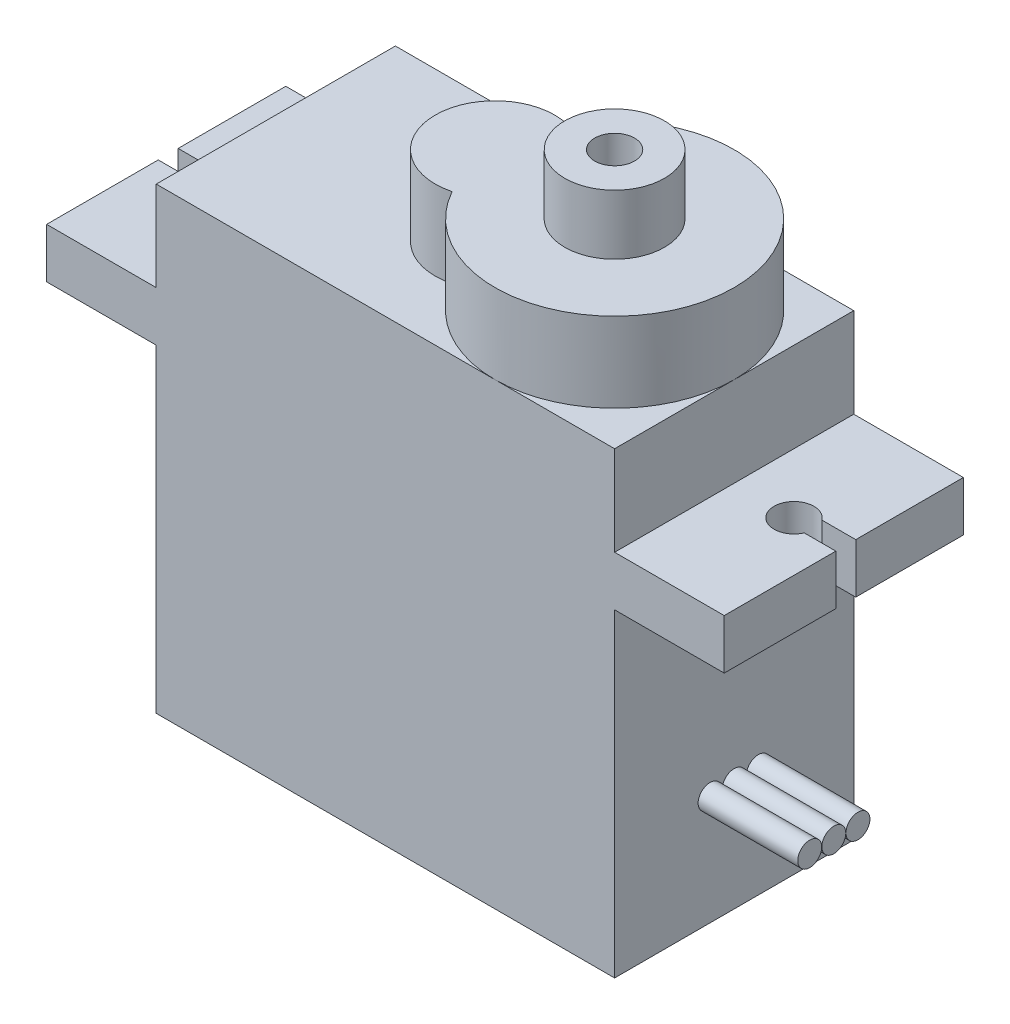
ISO-10303-21;
HEADER;
FILE_DESCRIPTION(('STEP AP214'),'2;1');
FILE_NAME('part.step','',(''),(''),'','','');
FILE_SCHEMA(('AUTOMOTIVE_DESIGN { 1 0 10303 214 1 1 1 1 }'));
ENDSEC;
DATA;
#1=APPLICATION_CONTEXT('core data for automotive mechanical design processes');
#2=APPLICATION_PROTOCOL_DEFINITION('international standard','automotive_design',2000,#1);
#3=PRODUCT_CONTEXT('',#1,'mechanical');
#4=PRODUCT('Part','Part','',(#3));
#5=PRODUCT_RELATED_PRODUCT_CATEGORY('part','',(#4));
#6=PRODUCT_DEFINITION_FORMATION('','',#4);
#7=PRODUCT_DEFINITION_CONTEXT('part definition',#1,'design');
#8=PRODUCT_DEFINITION('design','',#6,#7);
#9=PRODUCT_DEFINITION_SHAPE('','',#8);
#10=(LENGTH_UNIT() NAMED_UNIT(*) SI_UNIT(.MILLI.,.METRE.));
#11=(NAMED_UNIT(*) PLANE_ANGLE_UNIT() SI_UNIT($,.RADIAN.));
#12=(NAMED_UNIT(*) SI_UNIT($,.STERADIAN.) SOLID_ANGLE_UNIT());
#13=UNCERTAINTY_MEASURE_WITH_UNIT(LENGTH_MEASURE(1.E-05),#10,'distance_accuracy_value','');
#14=(GEOMETRIC_REPRESENTATION_CONTEXT(3) GLOBAL_UNCERTAINTY_ASSIGNED_CONTEXT((#13)) GLOBAL_UNIT_ASSIGNED_CONTEXT((#10,
#11,#12)) REPRESENTATION_CONTEXT('',''));
#15=CARTESIAN_POINT('',(0.,0.,0.));
#16=DIRECTION('',(0.,0.,1.));
#17=DIRECTION('',(1.,0.,0.));
#18=AXIS2_PLACEMENT_3D('',#15,#16,#17);
#19=CARTESIAN_POINT('',(0.,23.,0.));
#20=DIRECTION('',(0.,-1.,0.));
#21=DIRECTION('',(0.,0.,-1.));
#22=AXIS2_PLACEMENT_3D('',#19,#20,#21);
#23=PLANE('',#22);
#24=CARTESIAN_POINT('',(-0.5,23.,0.));
#25=DIRECTION('',(0.,1.,0.));
#26=DIRECTION('',(0.,0.,1.));
#27=AXIS2_PLACEMENT_3D('',#24,#25,#26);
#28=CIRCLE('',#27,3.);
#29=CARTESIAN_POINT('',(0.249999999999997,23.,-2.90473750965557));
#30=VERTEX_POINT('',#29);
#31=CARTESIAN_POINT('',(0.249999999999996,23.,2.90473750965556));
#32=VERTEX_POINT('',#31);
#33=EDGE_CURVE('E208',#30,#32,#28,.T.);
#34=ORIENTED_EDGE('',*,*,#33,.F.);
#35=CARTESIAN_POINT('',(5.5,23.,0.));
#36=DIRECTION('',(0.,1.,0.));
#37=DIRECTION('',(0.,0.,1.));
#38=AXIS2_PLACEMENT_3D('',#35,#36,#37);
#39=CIRCLE('',#38,6.);
#40=CARTESIAN_POINT('',(5.5,23.,-6.));
#41=VERTEX_POINT('',#40);
#42=EDGE_CURVE('E364',#41,#30,#39,.T.);
#43=ORIENTED_EDGE('',*,*,#42,.F.);
#44=DIRECTION('',(-1.,0.,0.));
#45=VECTOR('',#44,1.);
#46=CARTESIAN_POINT('',(-11.5,23.,-6.));
#47=LINE('',#46,#45);
#48=CARTESIAN_POINT('',(-11.5,23.,-6.));
#49=VERTEX_POINT('',#48);
#50=EDGE_CURVE('E315',#41,#49,#47,.T.);
#51=ORIENTED_EDGE('',*,*,#50,.T.);
#52=DIRECTION('',(0.,0.,1.));
#53=VECTOR('',#52,1.);
#54=CARTESIAN_POINT('',(-11.5,23.,6.));
#55=LINE('',#54,#53);
#56=CARTESIAN_POINT('',(-11.5,23.,6.));
#57=VERTEX_POINT('',#56);
#58=EDGE_CURVE('E320',#49,#57,#55,.T.);
#59=ORIENTED_EDGE('',*,*,#58,.T.);
#60=DIRECTION('',(1.,0.,0.));
#61=VECTOR('',#60,1.);
#62=CARTESIAN_POINT('',(-11.5,23.,6.));
#63=LINE('',#62,#61);
#64=CARTESIAN_POINT('',(5.5,23.,6.));
#65=VERTEX_POINT('',#64);
#66=EDGE_CURVE('E323',#57,#65,#63,.T.);
#67=ORIENTED_EDGE('',*,*,#66,.T.);
#68=EDGE_CURVE('E47',#32,#65,#39,.T.);
#69=ORIENTED_EDGE('',*,*,#68,.F.);
#70=EDGE_LOOP('',(#34,#43,#51,#59,#67,#69));
#71=FACE_BOUND('',#70,.T.);
#72=ADVANCED_FACE('F32',(#71),#23,.F.);
#73=CARTESIAN_POINT('',(11.5,23.,0.));
#74=VERTEX_POINT('',#73);
#75=EDGE_CURVE('E55',#65,#74,#39,.T.);
#76=ORIENTED_EDGE('',*,*,#75,.F.);
#77=CARTESIAN_POINT('',(11.5,23.,6.));
#78=VERTEX_POINT('',#77);
#79=EDGE_CURVE('E322',#65,#78,#63,.T.);
#80=ORIENTED_EDGE('',*,*,#79,.T.);
#81=DIRECTION('',(0.,0.,-1.));
#82=VECTOR('',#81,1.);
#83=CARTESIAN_POINT('',(11.5,23.,6.));
#84=LINE('',#83,#82);
#85=EDGE_CURVE('E313',#78,#74,#84,.T.);
#86=ORIENTED_EDGE('',*,*,#85,.T.);
#87=EDGE_LOOP('',(#76,#80,#86));
#88=FACE_BOUND('',#87,.T.);
#89=ADVANCED_FACE('F433',(#88),#23,.F.);
#90=CARTESIAN_POINT('',(17.,18.5,-6.));
#91=DIRECTION('',(0.,1.,0.));
#92=DIRECTION('',(0.,0.,1.));
#93=AXIS2_PLACEMENT_3D('',#90,#91,#92);
#94=PLANE('',#93);
#95=DIRECTION('',(0.,0.,-1.));
#96=VECTOR('',#95,1.);
#97=CARTESIAN_POINT('',(17.,18.5,-6.));
#98=LINE('',#97,#96);
#99=CARTESIAN_POINT('',(17.,18.5,6.));
#100=VERTEX_POINT('',#99);
#101=CARTESIAN_POINT('',(17.,18.5,0.4));
#102=VERTEX_POINT('',#101);
#103=EDGE_CURVE('E238',#100,#102,#98,.T.);
#104=ORIENTED_EDGE('',*,*,#103,.T.);
#105=DIRECTION('',(-1.,0.,0.));
#106=VECTOR('',#105,1.);
#107=CARTESIAN_POINT('',(17.,18.5,0.4));
#108=LINE('',#107,#106);
#109=CARTESIAN_POINT('',(15.4165151389912,18.5,0.4));
#110=VERTEX_POINT('',#109);
#111=EDGE_CURVE('E219',#102,#110,#108,.T.);
#112=ORIENTED_EDGE('',*,*,#111,.T.);
#113=CARTESIAN_POINT('',(14.5,18.5,0.));
#114=DIRECTION('',(0.,-1.,0.));
#115=DIRECTION('',(0.,0.,1.));
#116=AXIS2_PLACEMENT_3D('',#113,#114,#115);
#117=CIRCLE('',#116,1.);
#118=CARTESIAN_POINT('',(15.3,18.5,-0.6));
#119=VERTEX_POINT('',#118);
#120=EDGE_CURVE('E212',#110,#119,#117,.T.);
#121=ORIENTED_EDGE('',*,*,#120,.T.);
#122=DIRECTION('',(1.,0.,0.));
#123=VECTOR('',#122,1.);
#124=CARTESIAN_POINT('',(17.,18.5,-0.6));
#125=LINE('',#124,#123);
#126=CARTESIAN_POINT('',(17.,18.5,-0.6));
#127=VERTEX_POINT('',#126);
#128=EDGE_CURVE('E209',#119,#127,#125,.T.);
#129=ORIENTED_EDGE('',*,*,#128,.T.);
#130=CARTESIAN_POINT('',(17.,18.5,-6.));
#131=VERTEX_POINT('',#130);
#132=EDGE_CURVE('E236',#127,#131,#98,.T.);
#133=ORIENTED_EDGE('',*,*,#132,.T.);
#134=DIRECTION('',(-1.,0.,0.));
#135=VECTOR('',#134,1.);
#136=CARTESIAN_POINT('',(17.,18.5,-6.));
#137=LINE('',#136,#135);
#138=CARTESIAN_POINT('',(11.5,18.5,-6.));
#139=VERTEX_POINT('',#138);
#140=EDGE_CURVE('E258',#131,#139,#137,.T.);
#141=ORIENTED_EDGE('',*,*,#140,.T.);
#142=DIRECTION('',(0.,0.,-1.));
#143=VECTOR('',#142,1.);
#144=CARTESIAN_POINT('',(11.5,18.5,-6.));
#145=LINE('',#144,#143);
#146=CARTESIAN_POINT('',(11.5,18.5,6.));
#147=VERTEX_POINT('',#146);
#148=EDGE_CURVE('E232',#147,#139,#145,.T.);
#149=ORIENTED_EDGE('',*,*,#148,.F.);
#150=DIRECTION('',(-1.,0.,0.));
#151=VECTOR('',#150,1.);
#152=CARTESIAN_POINT('',(17.,18.5,6.));
#153=LINE('',#152,#151);
#154=EDGE_CURVE('E256',#100,#147,#153,.T.);
#155=ORIENTED_EDGE('',*,*,#154,.F.);
#156=EDGE_LOOP('',(#104,#112,#121,#129,#133,#141,#149,#155));
#157=FACE_BOUND('',#156,.T.);
#158=ADVANCED_FACE('F449',(#157),#94,.T.);
#159=CARTESIAN_POINT('',(17.,16.,-6.));
#160=DIRECTION('',(0.,-1.,0.));
#161=DIRECTION('',(0.,0.,-1.));
#162=AXIS2_PLACEMENT_3D('',#159,#160,#161);
#163=PLANE('',#162);
#164=CARTESIAN_POINT('',(14.5,16.,0.));
#165=DIRECTION('',(0.,-1.,0.));
#166=DIRECTION('',(0.,0.,-1.));
#167=AXIS2_PLACEMENT_3D('',#164,#165,#166);
#168=CIRCLE('',#167,1.);
#169=CARTESIAN_POINT('',(15.3,16.,-0.6));
#170=VERTEX_POINT('',#169);
#171=CARTESIAN_POINT('',(15.4165151389912,16.,0.4));
#172=VERTEX_POINT('',#171);
#173=EDGE_CURVE('E361',#170,#172,#168,.F.);
#174=ORIENTED_EDGE('',*,*,#173,.T.);
#175=DIRECTION('',(1.,0.,0.));
#176=VECTOR('',#175,1.);
#177=CARTESIAN_POINT('',(17.,16.,0.4));
#178=LINE('',#177,#176);
#179=CARTESIAN_POINT('',(17.,16.,0.4));
#180=VERTEX_POINT('',#179);
#181=EDGE_CURVE('E229',#172,#180,#178,.T.);
#182=ORIENTED_EDGE('',*,*,#181,.T.);
#183=DIRECTION('',(0.,0.,1.));
#184=VECTOR('',#183,1.);
#185=CARTESIAN_POINT('',(17.,16.,-6.));
#186=LINE('',#185,#184);
#187=CARTESIAN_POINT('',(17.,16.,6.));
#188=VERTEX_POINT('',#187);
#189=EDGE_CURVE('E244',#180,#188,#186,.T.);
#190=ORIENTED_EDGE('',*,*,#189,.T.);
#191=DIRECTION('',(-1.,0.,0.));
#192=VECTOR('',#191,1.);
#193=CARTESIAN_POINT('',(17.,16.,6.));
#194=LINE('',#193,#192);
#195=CARTESIAN_POINT('',(11.5,16.,6.));
#196=VERTEX_POINT('',#195);
#197=EDGE_CURVE('E254',#188,#196,#194,.T.);
#198=ORIENTED_EDGE('',*,*,#197,.T.);
#199=DIRECTION('',(0.,0.,1.));
#200=VECTOR('',#199,1.);
#201=CARTESIAN_POINT('',(11.5,16.,-6.));
#202=LINE('',#201,#200);
#203=CARTESIAN_POINT('',(11.5,16.,-6.));
#204=VERTEX_POINT('',#203);
#205=EDGE_CURVE('E237',#204,#196,#202,.T.);
#206=ORIENTED_EDGE('',*,*,#205,.F.);
#207=DIRECTION('',(-1.,0.,0.));
#208=VECTOR('',#207,1.);
#209=CARTESIAN_POINT('',(17.,16.,-6.));
#210=LINE('',#209,#208);
#211=CARTESIAN_POINT('',(17.,16.,-6.));
#212=VERTEX_POINT('',#211);
#213=EDGE_CURVE('E248',#212,#204,#210,.T.);
#214=ORIENTED_EDGE('',*,*,#213,.F.);
#215=CARTESIAN_POINT('',(17.,16.,-0.6));
#216=VERTEX_POINT('',#215);
#217=EDGE_CURVE('E245',#212,#216,#186,.T.);
#218=ORIENTED_EDGE('',*,*,#217,.T.);
#219=DIRECTION('',(-1.,0.,0.));
#220=VECTOR('',#219,1.);
#221=CARTESIAN_POINT('',(17.,16.,-0.6));
#222=LINE('',#221,#220);
#223=EDGE_CURVE('E225',#216,#170,#222,.T.);
#224=ORIENTED_EDGE('',*,*,#223,.T.);
#225=EDGE_LOOP('',(#174,#182,#190,#198,#206,#214,#218,#224));
#226=FACE_BOUND('',#225,.T.);
#227=ADVANCED_FACE('F442',(#226),#163,.T.);
#228=CARTESIAN_POINT('',(17.,0.,0.));
#229=DIRECTION('',(1.,0.,0.));
#230=DIRECTION('',(0.,0.,1.));
#231=AXIS2_PLACEMENT_3D('',#228,#229,#230);
#232=PLANE('',#231);
#233=ORIENTED_EDGE('',*,*,#189,.F.);
#234=DIRECTION('',(0.,1.,0.));
#235=VECTOR('',#234,1.);
#236=CARTESIAN_POINT('',(17.,0.,0.4));
#237=LINE('',#236,#235);
#238=EDGE_CURVE('E358',#180,#102,#237,.T.);
#239=ORIENTED_EDGE('',*,*,#238,.T.);
#240=ORIENTED_EDGE('',*,*,#103,.F.);
#241=DIRECTION('',(0.,1.,0.));
#242=VECTOR('',#241,1.);
#243=CARTESIAN_POINT('',(17.,18.5,6.));
#244=LINE('',#243,#242);
#245=EDGE_CURVE('E241',#188,#100,#244,.T.);
#246=ORIENTED_EDGE('',*,*,#245,.F.);
#247=EDGE_LOOP('',(#233,#239,#240,#246));
#248=FACE_BOUND('',#247,.T.);
#249=ADVANCED_FACE('F448',(#248),#232,.T.);
#250=ORIENTED_EDGE('',*,*,#132,.F.);
#251=DIRECTION('',(0.,-1.,0.));
#252=VECTOR('',#251,1.);
#253=CARTESIAN_POINT('',(17.,0.,-0.6));
#254=LINE('',#253,#252);
#255=EDGE_CURVE('E355',#127,#216,#254,.T.);
#256=ORIENTED_EDGE('',*,*,#255,.T.);
#257=ORIENTED_EDGE('',*,*,#217,.F.);
#258=DIRECTION('',(0.,-1.,0.));
#259=VECTOR('',#258,1.);
#260=CARTESIAN_POINT('',(17.,18.5,-6.));
#261=LINE('',#260,#259);
#262=EDGE_CURVE('E233',#131,#212,#261,.T.);
#263=ORIENTED_EDGE('',*,*,#262,.F.);
#264=EDGE_LOOP('',(#250,#256,#257,#263));
#265=FACE_BOUND('',#264,.T.);
#266=ADVANCED_FACE('F379',(#265),#232,.T.);
#267=CARTESIAN_POINT('',(11.5,23.,6.));
#268=DIRECTION('',(-1.,0.,0.));
#269=DIRECTION('',(0.,0.,1.));
#270=AXIS2_PLACEMENT_3D('',#267,#268,#269);
#271=PLANE('',#270);
#272=CARTESIAN_POINT('',(11.5,5.5,1.21));
#273=DIRECTION('',(-1.,0.,0.));
#274=DIRECTION('',(0.,0.,1.));
#275=AXIS2_PLACEMENT_3D('',#272,#273,#274);
#276=CIRCLE('',#275,0.6);
#277=CARTESIAN_POINT('',(11.5,5.5,1.81));
#278=VERTEX_POINT('',#277);
#279=EDGE_CURVE('E11',#278,#278,#276,.F.);
#280=ORIENTED_EDGE('',*,*,#279,.F.);
#281=EDGE_LOOP('',(#280));
#282=FACE_BOUND('',#281,.T.);
#283=CARTESIAN_POINT('',(11.5,5.5,-1.21));
#284=DIRECTION('',(-1.,0.,0.));
#285=DIRECTION('',(0.,0.,1.));
#286=AXIS2_PLACEMENT_3D('',#283,#284,#285);
#287=CIRCLE('',#286,0.6);
#288=CARTESIAN_POINT('',(11.5,5.5,-0.61));
#289=VERTEX_POINT('',#288);
#290=EDGE_CURVE('E40',#289,#289,#287,.F.);
#291=ORIENTED_EDGE('',*,*,#290,.F.);
#292=EDGE_LOOP('',(#291));
#293=FACE_BOUND('',#292,.T.);
#294=CARTESIAN_POINT('',(11.5,5.5,0.));
#295=DIRECTION('',(-1.,0.,0.));
#296=DIRECTION('',(0.,0.,1.));
#297=AXIS2_PLACEMENT_3D('',#294,#295,#296);
#298=CIRCLE('',#297,0.6);
#299=CARTESIAN_POINT('',(11.5,5.5,0.6));
#300=VERTEX_POINT('',#299);
#301=EDGE_CURVE('E368',#300,#300,#298,.F.);
#302=ORIENTED_EDGE('',*,*,#301,.F.);
#303=EDGE_LOOP('',(#302));
#304=FACE_BOUND('',#303,.T.);
#305=DIRECTION('',(0.,-1.,0.));
#306=VECTOR('',#305,1.);
#307=CARTESIAN_POINT('',(11.5,23.,-6.));
#308=LINE('',#307,#306);
#309=CARTESIAN_POINT('',(11.5,0.,-6.));
#310=VERTEX_POINT('',#309);
#311=EDGE_CURVE('E347',#204,#310,#308,.T.);
#312=ORIENTED_EDGE('',*,*,#311,.F.);
#313=ORIENTED_EDGE('',*,*,#205,.T.);
#314=DIRECTION('',(0.,-1.,0.));
#315=VECTOR('',#314,1.);
#316=CARTESIAN_POINT('',(11.5,23.,6.));
#317=LINE('',#316,#315);
#318=CARTESIAN_POINT('',(11.5,0.,6.));
#319=VERTEX_POINT('',#318);
#320=EDGE_CURVE('E325',#196,#319,#317,.T.);
#321=ORIENTED_EDGE('',*,*,#320,.T.);
#322=DIRECTION('',(0.,0.,-1.));
#323=VECTOR('',#322,1.);
#324=CARTESIAN_POINT('',(11.5,0.,6.));
#325=LINE('',#324,#323);
#326=EDGE_CURVE('E312',#319,#310,#325,.T.);
#327=ORIENTED_EDGE('',*,*,#326,.T.);
#328=EDGE_LOOP('',(#312,#313,#321,#327));
#329=FACE_BOUND('',#328,.T.);
#330=ADVANCED_FACE('F375',(#282,#293,#304,#329),#271,.F.);
#331=CARTESIAN_POINT('',(-17.,0.,0.));
#332=DIRECTION('',(-1.,0.,0.));
#333=DIRECTION('',(0.,0.,1.));
#334=AXIS2_PLACEMENT_3D('',#331,#332,#333);
#335=PLANE('',#334);
#336=DIRECTION('',(0.,-1.,0.));
#337=VECTOR('',#336,1.);
#338=CARTESIAN_POINT('',(-17.,0.,-0.6));
#339=LINE('',#338,#337);
#340=CARTESIAN_POINT('',(-17.,18.5,-0.6));
#341=VERTEX_POINT('',#340);
#342=CARTESIAN_POINT('',(-17.,16.,-0.6));
#343=VERTEX_POINT('',#342);
#344=EDGE_CURVE('E353',#341,#343,#339,.T.);
#345=ORIENTED_EDGE('',*,*,#344,.F.);
#346=DIRECTION('',(0.,0.,-1.));
#347=VECTOR('',#346,1.);
#348=CARTESIAN_POINT('',(-17.,18.5,-6.));
#349=LINE('',#348,#347);
#350=CARTESIAN_POINT('',(-17.,18.5,-6.));
#351=VERTEX_POINT('',#350);
#352=EDGE_CURVE('E292',#341,#351,#349,.T.);
#353=ORIENTED_EDGE('',*,*,#352,.T.);
#354=DIRECTION('',(0.,-1.,0.));
#355=VECTOR('',#354,1.);
#356=CARTESIAN_POINT('',(-17.,18.5,-6.));
#357=LINE('',#356,#355);
#358=CARTESIAN_POINT('',(-17.,16.,-6.));
#359=VERTEX_POINT('',#358);
#360=EDGE_CURVE('E282',#351,#359,#357,.T.);
#361=ORIENTED_EDGE('',*,*,#360,.T.);
#362=DIRECTION('',(0.,0.,1.));
#363=VECTOR('',#362,1.);
#364=CARTESIAN_POINT('',(-17.,16.,-6.));
#365=LINE('',#364,#363);
#366=EDGE_CURVE('E287',#359,#343,#365,.T.);
#367=ORIENTED_EDGE('',*,*,#366,.T.);
#368=EDGE_LOOP('',(#345,#353,#361,#367));
#369=FACE_BOUND('',#368,.T.);
#370=ADVANCED_FACE('F378',(#369),#335,.T.);
#371=CARTESIAN_POINT('',(-11.5,23.,6.));
#372=DIRECTION('',(1.,0.,0.));
#373=DIRECTION('',(0.,0.,-1.));
#374=AXIS2_PLACEMENT_3D('',#371,#372,#373);
#375=PLANE('',#374);
#376=DIRECTION('',(0.,0.,-1.));
#377=VECTOR('',#376,1.);
#378=CARTESIAN_POINT('',(-11.5,18.5,-6.));
#379=LINE('',#378,#377);
#380=CARTESIAN_POINT('',(-11.5,18.5,6.));
#381=VERTEX_POINT('',#380);
#382=CARTESIAN_POINT('',(-11.5,18.5,-6.));
#383=VERTEX_POINT('',#382);
#384=EDGE_CURVE('E286',#381,#383,#379,.T.);
#385=ORIENTED_EDGE('',*,*,#384,.F.);
#386=DIRECTION('',(0.,-1.,0.));
#387=VECTOR('',#386,1.);
#388=CARTESIAN_POINT('',(-11.5,23.,6.));
#389=LINE('',#388,#387);
#390=EDGE_CURVE('E341',#57,#381,#389,.T.);
#391=ORIENTED_EDGE('',*,*,#390,.F.);
#392=ORIENTED_EDGE('',*,*,#58,.F.);
#393=DIRECTION('',(0.,-1.,0.));
#394=VECTOR('',#393,1.);
#395=CARTESIAN_POINT('',(-11.5,23.,-6.));
#396=LINE('',#395,#394);
#397=EDGE_CURVE('E345',#49,#383,#396,.T.);
#398=ORIENTED_EDGE('',*,*,#397,.T.);
#399=EDGE_LOOP('',(#385,#391,#392,#398));
#400=FACE_BOUND('',#399,.T.);
#401=ADVANCED_FACE('F416',(#400),#375,.F.);
#402=DIRECTION('',(0.,0.,1.));
#403=VECTOR('',#402,1.);
#404=CARTESIAN_POINT('',(-11.5,16.,-6.));
#405=LINE('',#404,#403);
#406=CARTESIAN_POINT('',(-11.5,16.,-6.));
#407=VERTEX_POINT('',#406);
#408=CARTESIAN_POINT('',(-11.5,16.,6.));
#409=VERTEX_POINT('',#408);
#410=EDGE_CURVE('E281',#407,#409,#405,.T.);
#411=ORIENTED_EDGE('',*,*,#410,.F.);
#412=CARTESIAN_POINT('',(-11.5,0.,-6.));
#413=VERTEX_POINT('',#412);
#414=EDGE_CURVE('E344',#407,#413,#396,.T.);
#415=ORIENTED_EDGE('',*,*,#414,.T.);
#416=DIRECTION('',(0.,0.,1.));
#417=VECTOR('',#416,1.);
#418=CARTESIAN_POINT('',(-11.5,0.,6.));
#419=LINE('',#418,#417);
#420=CARTESIAN_POINT('',(-11.5,0.,6.));
#421=VERTEX_POINT('',#420);
#422=EDGE_CURVE('E331',#413,#421,#419,.T.);
#423=ORIENTED_EDGE('',*,*,#422,.T.);
#424=EDGE_CURVE('E340',#409,#421,#389,.T.);
#425=ORIENTED_EDGE('',*,*,#424,.F.);
#426=EDGE_LOOP('',(#411,#415,#423,#425));
#427=FACE_BOUND('',#426,.T.);
#428=ADVANCED_FACE('F396',(#427),#375,.F.);
#429=EDGE_CURVE('E337',#78,#147,#317,.T.);
#430=ORIENTED_EDGE('',*,*,#429,.T.);
#431=ORIENTED_EDGE('',*,*,#148,.T.);
#432=CARTESIAN_POINT('',(11.5,23.,-6.));
#433=VERTEX_POINT('',#432);
#434=EDGE_CURVE('E348',#433,#139,#308,.T.);
#435=ORIENTED_EDGE('',*,*,#434,.F.);
#436=EDGE_CURVE('E316',#74,#433,#84,.T.);
#437=ORIENTED_EDGE('',*,*,#436,.F.);
#438=ORIENTED_EDGE('',*,*,#85,.F.);
#439=EDGE_LOOP('',(#430,#431,#435,#437,#438));
#440=FACE_BOUND('',#439,.T.);
#441=ADVANCED_FACE('F34',(#440),#271,.F.);
#442=CARTESIAN_POINT('',(-11.5,23.,-6.));
#443=DIRECTION('',(0.,0.,1.));
#444=DIRECTION('',(1.,0.,0.));
#445=AXIS2_PLACEMENT_3D('',#442,#443,#444);
#446=PLANE('',#445);
#447=DIRECTION('',(-1.,0.,0.));
#448=VECTOR('',#447,1.);
#449=CARTESIAN_POINT('',(-11.5,0.,-6.));
#450=LINE('',#449,#448);
#451=EDGE_CURVE('E328',#310,#413,#450,.T.);
#452=ORIENTED_EDGE('',*,*,#451,.T.);
#453=ORIENTED_EDGE('',*,*,#414,.F.);
#454=DIRECTION('',(1.,0.,0.));
#455=VECTOR('',#454,1.);
#456=CARTESIAN_POINT('',(-17.,16.,-6.));
#457=LINE('',#456,#455);
#458=EDGE_CURVE('E309',#359,#407,#457,.T.);
#459=ORIENTED_EDGE('',*,*,#458,.F.);
#460=ORIENTED_EDGE('',*,*,#360,.F.);
#461=DIRECTION('',(1.,0.,0.));
#462=VECTOR('',#461,1.);
#463=CARTESIAN_POINT('',(-17.,18.5,-6.));
#464=LINE('',#463,#462);
#465=EDGE_CURVE('E296',#351,#383,#464,.T.);
#466=ORIENTED_EDGE('',*,*,#465,.T.);
#467=ORIENTED_EDGE('',*,*,#397,.F.);
#468=ORIENTED_EDGE('',*,*,#50,.F.);
#469=EDGE_CURVE('E317',#433,#41,#47,.T.);
#470=ORIENTED_EDGE('',*,*,#469,.F.);
#471=ORIENTED_EDGE('',*,*,#434,.T.);
#472=ORIENTED_EDGE('',*,*,#140,.F.);
#473=ORIENTED_EDGE('',*,*,#262,.T.);
#474=ORIENTED_EDGE('',*,*,#213,.T.);
#475=ORIENTED_EDGE('',*,*,#311,.T.);
#476=EDGE_LOOP('',(#452,#453,#459,#460,#466,#467,#468,#470,#471,#472,#473,#474,#475));
#477=FACE_BOUND('',#476,.T.);
#478=ADVANCED_FACE('F389',(#477),#446,.F.);
#479=CARTESIAN_POINT('',(-11.5,23.,6.));
#480=DIRECTION('',(0.,0.,-1.));
#481=DIRECTION('',(-1.,0.,0.));
#482=AXIS2_PLACEMENT_3D('',#479,#480,#481);
#483=PLANE('',#482);
#484=DIRECTION('',(1.,0.,0.));
#485=VECTOR('',#484,1.);
#486=CARTESIAN_POINT('',(-11.5,0.,6.));
#487=LINE('',#486,#485);
#488=EDGE_CURVE('E334',#421,#319,#487,.T.);
#489=ORIENTED_EDGE('',*,*,#488,.T.);
#490=ORIENTED_EDGE('',*,*,#320,.F.);
#491=ORIENTED_EDGE('',*,*,#197,.F.);
#492=ORIENTED_EDGE('',*,*,#245,.T.);
#493=ORIENTED_EDGE('',*,*,#154,.T.);
#494=ORIENTED_EDGE('',*,*,#429,.F.);
#495=ORIENTED_EDGE('',*,*,#79,.F.);
#496=ORIENTED_EDGE('',*,*,#66,.F.);
#497=ORIENTED_EDGE('',*,*,#390,.T.);
#498=DIRECTION('',(1.,0.,0.));
#499=VECTOR('',#498,1.);
#500=CARTESIAN_POINT('',(-17.,18.5,6.));
#501=LINE('',#500,#499);
#502=CARTESIAN_POINT('',(-17.,18.5,6.));
#503=VERTEX_POINT('',#502);
#504=EDGE_CURVE('E303',#503,#381,#501,.T.);
#505=ORIENTED_EDGE('',*,*,#504,.F.);
#506=DIRECTION('',(0.,1.,0.));
#507=VECTOR('',#506,1.);
#508=CARTESIAN_POINT('',(-17.,18.5,6.));
#509=LINE('',#508,#507);
#510=CARTESIAN_POINT('',(-17.,16.,6.));
#511=VERTEX_POINT('',#510);
#512=EDGE_CURVE('E290',#511,#503,#509,.T.);
#513=ORIENTED_EDGE('',*,*,#512,.F.);
#514=DIRECTION('',(1.,0.,0.));
#515=VECTOR('',#514,1.);
#516=CARTESIAN_POINT('',(-17.,16.,6.));
#517=LINE('',#516,#515);
#518=EDGE_CURVE('E306',#511,#409,#517,.T.);
#519=ORIENTED_EDGE('',*,*,#518,.T.);
#520=ORIENTED_EDGE('',*,*,#424,.T.);
#521=EDGE_LOOP('',(#489,#490,#491,#492,#493,#494,#495,#496,#497,#505,#513,#519,#520));
#522=FACE_BOUND('',#521,.T.);
#523=ADVANCED_FACE('F419',(#522),#483,.F.);
#524=EDGE_CURVE('E425',#74,#41,#39,.T.);
#525=ORIENTED_EDGE('',*,*,#524,.F.);
#526=ORIENTED_EDGE('',*,*,#436,.T.);
#527=ORIENTED_EDGE('',*,*,#469,.T.);
#528=EDGE_LOOP('',(#525,#526,#527));
#529=FACE_BOUND('',#528,.T.);
#530=ADVANCED_FACE('F428',(#529),#23,.F.);
#531=CARTESIAN_POINT('',(0.,0.,0.));
#532=DIRECTION('',(0.,-1.,0.));
#533=DIRECTION('',(0.,0.,-1.));
#534=AXIS2_PLACEMENT_3D('',#531,#532,#533);
#535=PLANE('',#534);
#536=ORIENTED_EDGE('',*,*,#326,.F.);
#537=ORIENTED_EDGE('',*,*,#488,.F.);
#538=ORIENTED_EDGE('',*,*,#422,.F.);
#539=ORIENTED_EDGE('',*,*,#451,.F.);
#540=EDGE_LOOP('',(#536,#537,#538,#539));
#541=FACE_BOUND('',#540,.T.);
#542=ADVANCED_FACE('F393',(#541),#535,.T.);
#543=CARTESIAN_POINT('',(-17.,16.,-6.));
#544=DIRECTION('',(0.,1.,0.));
#545=DIRECTION('',(0.,0.,1.));
#546=AXIS2_PLACEMENT_3D('',#543,#544,#545);
#547=PLANE('',#546);
#548=CARTESIAN_POINT('',(-14.5,16.,0.));
#549=DIRECTION('',(0.,1.,0.));
#550=DIRECTION('',(0.,0.,1.));
#551=AXIS2_PLACEMENT_3D('',#548,#549,#550);
#552=CIRCLE('',#551,1.);
#553=CARTESIAN_POINT('',(-15.4165151389912,16.,0.4));
#554=VERTEX_POINT('',#553);
#555=CARTESIAN_POINT('',(-15.3,16.,-0.6));
#556=VERTEX_POINT('',#555);
#557=EDGE_CURVE('E278',#554,#556,#552,.T.);
#558=ORIENTED_EDGE('',*,*,#557,.T.);
#559=DIRECTION('',(-1.,0.,0.));
#560=VECTOR('',#559,1.);
#561=CARTESIAN_POINT('',(-17.,16.,-0.6));
#562=LINE('',#561,#560);
#563=EDGE_CURVE('E275',#556,#343,#562,.T.);
#564=ORIENTED_EDGE('',*,*,#563,.T.);
#565=ORIENTED_EDGE('',*,*,#366,.F.);
#566=ORIENTED_EDGE('',*,*,#458,.T.);
#567=ORIENTED_EDGE('',*,*,#410,.T.);
#568=ORIENTED_EDGE('',*,*,#518,.F.);
#569=CARTESIAN_POINT('',(-17.,16.,0.4));
#570=VERTEX_POINT('',#569);
#571=EDGE_CURVE('E285',#570,#511,#365,.T.);
#572=ORIENTED_EDGE('',*,*,#571,.F.);
#573=DIRECTION('',(1.,0.,0.));
#574=VECTOR('',#573,1.);
#575=CARTESIAN_POINT('',(-17.,16.,0.4));
#576=LINE('',#575,#574);
#577=EDGE_CURVE('E271',#570,#554,#576,.T.);
#578=ORIENTED_EDGE('',*,*,#577,.T.);
#579=EDGE_LOOP('',(#558,#564,#565,#566,#567,#568,#572,#578));
#580=FACE_BOUND('',#579,.T.);
#581=ADVANCED_FACE('F400',(#580),#547,.F.);
#582=CARTESIAN_POINT('',(-17.,18.5,-6.));
#583=DIRECTION('',(0.,-1.,0.));
#584=DIRECTION('',(0.,0.,-1.));
#585=AXIS2_PLACEMENT_3D('',#582,#583,#584);
#586=PLANE('',#585);
#587=ORIENTED_EDGE('',*,*,#352,.F.);
#588=DIRECTION('',(-1.,0.,0.));
#589=VECTOR('',#588,1.);
#590=CARTESIAN_POINT('',(-17.,18.5,-0.6));
#591=LINE('',#590,#589);
#592=CARTESIAN_POINT('',(-15.3,18.5,-0.6));
#593=VERTEX_POINT('',#592);
#594=EDGE_CURVE('E266',#593,#341,#591,.T.);
#595=ORIENTED_EDGE('',*,*,#594,.F.);
#596=CARTESIAN_POINT('',(-14.5,18.5,0.));
#597=DIRECTION('',(0.,1.,0.));
#598=DIRECTION('',(0.,0.,1.));
#599=AXIS2_PLACEMENT_3D('',#596,#597,#598);
#600=CIRCLE('',#599,1.);
#601=CARTESIAN_POINT('',(-15.4165151389912,18.5,0.4));
#602=VERTEX_POINT('',#601);
#603=EDGE_CURVE('E263',#602,#593,#600,.T.);
#604=ORIENTED_EDGE('',*,*,#603,.F.);
#605=DIRECTION('',(1.,0.,0.));
#606=VECTOR('',#605,1.);
#607=CARTESIAN_POINT('',(-17.,18.5,0.4));
#608=LINE('',#607,#606);
#609=CARTESIAN_POINT('',(-17.,18.5,0.4));
#610=VERTEX_POINT('',#609);
#611=EDGE_CURVE('E260',#610,#602,#608,.T.);
#612=ORIENTED_EDGE('',*,*,#611,.F.);
#613=EDGE_CURVE('E293',#503,#610,#349,.T.);
#614=ORIENTED_EDGE('',*,*,#613,.F.);
#615=ORIENTED_EDGE('',*,*,#504,.T.);
#616=ORIENTED_EDGE('',*,*,#384,.T.);
#617=ORIENTED_EDGE('',*,*,#465,.F.);
#618=EDGE_LOOP('',(#587,#595,#604,#612,#614,#615,#616,#617));
#619=FACE_BOUND('',#618,.T.);
#620=ADVANCED_FACE('F410',(#619),#586,.F.);
#621=DIRECTION('',(0.,1.,0.));
#622=VECTOR('',#621,1.);
#623=CARTESIAN_POINT('',(-17.,0.,0.4));
#624=LINE('',#623,#622);
#625=EDGE_CURVE('E351',#570,#610,#624,.T.);
#626=ORIENTED_EDGE('',*,*,#625,.F.);
#627=ORIENTED_EDGE('',*,*,#571,.T.);
#628=ORIENTED_EDGE('',*,*,#512,.T.);
#629=ORIENTED_EDGE('',*,*,#613,.T.);
#630=EDGE_LOOP('',(#626,#627,#628,#629));
#631=FACE_BOUND('',#630,.T.);
#632=ADVANCED_FACE('F492',(#631),#335,.T.);
#633=CARTESIAN_POINT('',(-14.5,13.5,0.));
#634=DIRECTION('',(0.,1.,0.));
#635=DIRECTION('',(0.,0.,1.));
#636=AXIS2_PLACEMENT_3D('',#633,#634,#635);
#637=CYLINDRICAL_SURFACE('',#636,1.);
#638=DIRECTION('',(0.,1.,0.));
#639=VECTOR('',#638,1.);
#640=CARTESIAN_POINT('',(-15.4165151389912,13.5,0.4));
#641=LINE('',#640,#639);
#642=EDGE_CURVE('E268',#554,#602,#641,.T.);
#643=ORIENTED_EDGE('',*,*,#642,.T.);
#644=ORIENTED_EDGE('',*,*,#603,.T.);
#645=DIRECTION('',(0.,1.,0.));
#646=VECTOR('',#645,1.);
#647=CARTESIAN_POINT('',(-15.3,13.5,-0.6));
#648=LINE('',#647,#646);
#649=EDGE_CURVE('E269',#556,#593,#648,.T.);
#650=ORIENTED_EDGE('',*,*,#649,.F.);
#651=ORIENTED_EDGE('',*,*,#557,.F.);
#652=EDGE_LOOP('',(#643,#644,#650,#651));
#653=FACE_BOUND('',#652,.T.);
#654=ADVANCED_FACE('F498',(#653),#637,.F.);
#655=CARTESIAN_POINT('',(-17.,13.5,-0.6));
#656=DIRECTION('',(0.,0.,-1.));
#657=DIRECTION('',(-1.,0.,0.));
#658=AXIS2_PLACEMENT_3D('',#655,#656,#657);
#659=PLANE('',#658);
#660=ORIENTED_EDGE('',*,*,#649,.T.);
#661=ORIENTED_EDGE('',*,*,#594,.T.);
#662=ORIENTED_EDGE('',*,*,#344,.T.);
#663=ORIENTED_EDGE('',*,*,#563,.F.);
#664=EDGE_LOOP('',(#660,#661,#662,#663));
#665=FACE_BOUND('',#664,.T.);
#666=ADVANCED_FACE('F504',(#665),#659,.F.);
#667=CARTESIAN_POINT('',(-17.,13.5,0.4));
#668=DIRECTION('',(0.,0.,1.));
#669=DIRECTION('',(1.,0.,0.));
#670=AXIS2_PLACEMENT_3D('',#667,#668,#669);
#671=PLANE('',#670);
#672=ORIENTED_EDGE('',*,*,#625,.T.);
#673=ORIENTED_EDGE('',*,*,#611,.T.);
#674=ORIENTED_EDGE('',*,*,#642,.F.);
#675=ORIENTED_EDGE('',*,*,#577,.F.);
#676=EDGE_LOOP('',(#672,#673,#674,#675));
#677=FACE_BOUND('',#676,.T.);
#678=ADVANCED_FACE('F512',(#677),#671,.F.);
#679=CARTESIAN_POINT('',(17.,13.5,0.4));
#680=DIRECTION('',(0.,0.,-1.));
#681=DIRECTION('',(-1.,0.,0.));
#682=AXIS2_PLACEMENT_3D('',#679,#680,#681);
#683=PLANE('',#682);
#684=DIRECTION('',(0.,1.,0.));
#685=VECTOR('',#684,1.);
#686=CARTESIAN_POINT('',(15.4165151389912,13.5,0.4));
#687=LINE('',#686,#685);
#688=EDGE_CURVE('E223',#172,#110,#687,.T.);
#689=ORIENTED_EDGE('',*,*,#688,.T.);
#690=ORIENTED_EDGE('',*,*,#111,.F.);
#691=ORIENTED_EDGE('',*,*,#238,.F.);
#692=ORIENTED_EDGE('',*,*,#181,.F.);
#693=EDGE_LOOP('',(#689,#690,#691,#692));
#694=FACE_BOUND('',#693,.T.);
#695=ADVANCED_FACE('F452',(#694),#683,.T.);
#696=CARTESIAN_POINT('',(14.5,13.5,0.));
#697=DIRECTION('',(0.,1.,0.));
#698=DIRECTION('',(0.,0.,1.));
#699=AXIS2_PLACEMENT_3D('',#696,#697,#698);
#700=CYLINDRICAL_SURFACE('',#699,1.);
#701=DIRECTION('',(0.,1.,0.));
#702=VECTOR('',#701,1.);
#703=CARTESIAN_POINT('',(15.3,13.5,-0.6));
#704=LINE('',#703,#702);
#705=EDGE_CURVE('E222',#170,#119,#704,.T.);
#706=ORIENTED_EDGE('',*,*,#705,.T.);
#707=ORIENTED_EDGE('',*,*,#120,.F.);
#708=ORIENTED_EDGE('',*,*,#688,.F.);
#709=ORIENTED_EDGE('',*,*,#173,.F.);
#710=EDGE_LOOP('',(#706,#707,#708,#709));
#711=FACE_BOUND('',#710,.T.);
#712=ADVANCED_FACE('F455',(#711),#700,.F.);
#713=CARTESIAN_POINT('',(17.,13.5,-0.6));
#714=DIRECTION('',(0.,0.,1.));
#715=DIRECTION('',(1.,0.,0.));
#716=AXIS2_PLACEMENT_3D('',#713,#714,#715);
#717=PLANE('',#716);
#718=ORIENTED_EDGE('',*,*,#255,.F.);
#719=ORIENTED_EDGE('',*,*,#128,.F.);
#720=ORIENTED_EDGE('',*,*,#705,.F.);
#721=ORIENTED_EDGE('',*,*,#223,.F.);
#722=EDGE_LOOP('',(#718,#719,#720,#721));
#723=FACE_BOUND('',#722,.T.);
#724=ADVANCED_FACE('F459',(#723),#717,.T.);
#725=CARTESIAN_POINT('',(-0.5,27.,0.));
#726=DIRECTION('',(0.,-1.,0.));
#727=DIRECTION('',(0.,0.,-1.));
#728=AXIS2_PLACEMENT_3D('',#725,#726,#727);
#729=CYLINDRICAL_SURFACE('',#728,3.);
#730=ORIENTED_EDGE('',*,*,#33,.T.);
#731=DIRECTION('',(0.,-1.,0.));
#732=VECTOR('',#731,1.);
#733=CARTESIAN_POINT('',(0.249999999999996,27.,2.90473750965556));
#734=LINE('',#733,#732);
#735=CARTESIAN_POINT('',(0.249999999999996,27.,2.90473750965556));
#736=VERTEX_POINT('',#735);
#737=EDGE_CURVE('E195',#736,#32,#734,.T.);
#738=ORIENTED_EDGE('',*,*,#737,.F.);
#739=CARTESIAN_POINT('',(-0.5,27.,0.));
#740=DIRECTION('',(0.,1.,0.));
#741=DIRECTION('',(0.,0.,1.));
#742=AXIS2_PLACEMENT_3D('',#739,#740,#741);
#743=CIRCLE('',#742,3.);
#744=CARTESIAN_POINT('',(0.249999999999997,27.,-2.90473750965557));
#745=VERTEX_POINT('',#744);
#746=EDGE_CURVE('E202',#745,#736,#743,.T.);
#747=ORIENTED_EDGE('',*,*,#746,.F.);
#748=DIRECTION('',(0.,-1.,0.));
#749=VECTOR('',#748,1.);
#750=CARTESIAN_POINT('',(0.249999999999997,27.,-2.90473750965557));
#751=LINE('',#750,#749);
#752=EDGE_CURVE('E199',#745,#30,#751,.T.);
#753=ORIENTED_EDGE('',*,*,#752,.T.);
#754=EDGE_LOOP('',(#730,#738,#747,#753));
#755=FACE_BOUND('',#754,.T.);
#756=ADVANCED_FACE('F207',(#755),#729,.T.);
#757=CARTESIAN_POINT('',(5.5,27.,0.));
#758=DIRECTION('',(0.,-1.,0.));
#759=DIRECTION('',(0.,0.,-1.));
#760=AXIS2_PLACEMENT_3D('',#757,#758,#759);
#761=CYLINDRICAL_SURFACE('',#760,6.);
#762=ORIENTED_EDGE('',*,*,#68,.T.);
#763=ORIENTED_EDGE('',*,*,#75,.T.);
#764=ORIENTED_EDGE('',*,*,#524,.T.);
#765=ORIENTED_EDGE('',*,*,#42,.T.);
#766=ORIENTED_EDGE('',*,*,#752,.F.);
#767=CARTESIAN_POINT('',(5.5,27.,0.));
#768=DIRECTION('',(0.,1.,0.));
#769=DIRECTION('',(0.,0.,1.));
#770=AXIS2_PLACEMENT_3D('',#767,#768,#769);
#771=CIRCLE('',#770,6.);
#772=EDGE_CURVE('E191',#736,#745,#771,.T.);
#773=ORIENTED_EDGE('',*,*,#772,.F.);
#774=ORIENTED_EDGE('',*,*,#737,.T.);
#775=EDGE_LOOP('',(#762,#763,#764,#765,#766,#773,#774));
#776=FACE_BOUND('',#775,.T.);
#777=ADVANCED_FACE('F193',(#776),#761,.T.);
#778=CARTESIAN_POINT('',(2.5,27.,0.));
#779=DIRECTION('',(0.,1.,0.));
#780=DIRECTION('',(0.,0.,1.));
#781=AXIS2_PLACEMENT_3D('',#778,#779,#780);
#782=PLANE('',#781);
#783=CARTESIAN_POINT('',(5.5,27.,0.));
#784=DIRECTION('',(0.,1.,0.));
#785=DIRECTION('',(0.,0.,1.));
#786=AXIS2_PLACEMENT_3D('',#783,#784,#785);
#787=CIRCLE('',#786,2.5);
#788=CARTESIAN_POINT('',(5.5,27.,2.5));
#789=VERTEX_POINT('',#788);
#790=EDGE_CURVE('E797',#789,#789,#787,.T.);
#791=ORIENTED_EDGE('',*,*,#790,.F.);
#792=EDGE_LOOP('',(#791));
#793=FACE_BOUND('',#792,.T.);
#794=ORIENTED_EDGE('',*,*,#746,.T.);
#795=ORIENTED_EDGE('',*,*,#772,.T.);
#796=EDGE_LOOP('',(#794,#795));
#797=FACE_BOUND('',#796,.T.);
#798=ADVANCED_FACE('F204',(#793,#797),#782,.T.);
#799=CARTESIAN_POINT('',(5.5,30.,0.));
#800=DIRECTION('',(0.,1.,0.));
#801=DIRECTION('',(0.,0.,1.));
#802=AXIS2_PLACEMENT_3D('',#799,#800,#801);
#803=PLANE('',#802);
#804=CARTESIAN_POINT('',(5.5,30.,0.));
#805=DIRECTION('',(0.,1.,0.));
#806=DIRECTION('',(0.,0.,1.));
#807=AXIS2_PLACEMENT_3D('',#804,#805,#806);
#808=CIRCLE('',#807,2.5);
#809=CARTESIAN_POINT('',(5.5,30.,2.5));
#810=VERTEX_POINT('',#809);
#811=EDGE_CURVE('E423',#810,#810,#808,.T.);
#812=ORIENTED_EDGE('',*,*,#811,.T.);
#813=EDGE_LOOP('',(#812));
#814=FACE_BOUND('',#813,.T.);
#815=CARTESIAN_POINT('',(5.5,30.,0.));
#816=DIRECTION('',(0.,1.,0.));
#817=DIRECTION('',(0.,0.,1.));
#818=AXIS2_PLACEMENT_3D('',#815,#816,#817);
#819=CIRCLE('',#818,1.);
#820=CARTESIAN_POINT('',(5.5,30.,1.));
#821=VERTEX_POINT('',#820);
#822=EDGE_CURVE('E799',#821,#821,#819,.T.);
#823=ORIENTED_EDGE('',*,*,#822,.F.);
#824=EDGE_LOOP('',(#823));
#825=FACE_BOUND('',#824,.T.);
#826=ADVANCED_FACE('F615',(#814,#825),#803,.T.);
#827=CARTESIAN_POINT('',(5.5,30.,0.));
#828=DIRECTION('',(0.,-1.,0.));
#829=DIRECTION('',(0.,0.,-1.));
#830=AXIS2_PLACEMENT_3D('',#827,#828,#829);
#831=CYLINDRICAL_SURFACE('',#830,2.5);
#832=ORIENTED_EDGE('',*,*,#811,.F.);
#833=EDGE_LOOP('',(#832));
#834=FACE_BOUND('',#833,.T.);
#835=ORIENTED_EDGE('',*,*,#790,.T.);
#836=EDGE_LOOP('',(#835));
#837=FACE_BOUND('',#836,.T.);
#838=ADVANCED_FACE('F613',(#834,#837),#831,.T.);
#839=CARTESIAN_POINT('',(5.5,30.,0.));
#840=DIRECTION('',(0.,-1.,0.));
#841=DIRECTION('',(0.,0.,-1.));
#842=AXIS2_PLACEMENT_3D('',#839,#840,#841);
#843=CYLINDRICAL_SURFACE('',#842,1.);
#844=ORIENTED_EDGE('',*,*,#822,.T.);
#845=EDGE_LOOP('',(#844));
#846=FACE_BOUND('',#845,.T.);
#847=CARTESIAN_POINT('',(5.5,27.,0.));
#848=DIRECTION('',(0.,1.,0.));
#849=DIRECTION('',(0.,0.,1.));
#850=AXIS2_PLACEMENT_3D('',#847,#848,#849);
#851=CIRCLE('',#850,1.);
#852=CARTESIAN_POINT('',(5.5,27.,1.));
#853=VERTEX_POINT('',#852);
#854=EDGE_CURVE('E365',#853,#853,#851,.F.);
#855=ORIENTED_EDGE('',*,*,#854,.T.);
#856=EDGE_LOOP('',(#855));
#857=FACE_BOUND('',#856,.T.);
#858=ADVANCED_FACE('F610',(#846,#857),#843,.F.);
#859=ORIENTED_EDGE('',*,*,#854,.F.);
#860=EDGE_LOOP('',(#859));
#861=FACE_BOUND('',#860,.T.);
#862=ADVANCED_FACE('F544',(#861),#782,.T.);
#863=CARTESIAN_POINT('',(16.5,5.5,0.));
#864=DIRECTION('',(-1.,0.,0.));
#865=DIRECTION('',(0.,0.,1.));
#866=AXIS2_PLACEMENT_3D('',#863,#864,#865);
#867=CYLINDRICAL_SURFACE('',#866,0.6);
#868=CARTESIAN_POINT('',(16.5,5.5,0.));
#869=DIRECTION('',(1.,0.,0.));
#870=DIRECTION('',(0.,0.,-1.));
#871=AXIS2_PLACEMENT_3D('',#868,#869,#870);
#872=CIRCLE('',#871,0.6);
#873=CARTESIAN_POINT('',(16.5,5.5,-0.6));
#874=VERTEX_POINT('',#873);
#875=EDGE_CURVE('E804',#874,#874,#872,.T.);
#876=ORIENTED_EDGE('',*,*,#875,.F.);
#877=EDGE_LOOP('',(#876));
#878=FACE_BOUND('',#877,.T.);
#879=ORIENTED_EDGE('',*,*,#301,.T.);
#880=EDGE_LOOP('',(#879));
#881=FACE_BOUND('',#880,.T.);
#882=ADVANCED_FACE('F549',(#878,#881),#867,.T.);
#883=CARTESIAN_POINT('',(16.5,5.5,0.));
#884=DIRECTION('',(1.,0.,0.));
#885=DIRECTION('',(0.,0.,-1.));
#886=AXIS2_PLACEMENT_3D('',#883,#884,#885);
#887=PLANE('',#886);
#888=ORIENTED_EDGE('',*,*,#875,.T.);
#889=EDGE_LOOP('',(#888));
#890=FACE_BOUND('',#889,.T.);
#891=ADVANCED_FACE('F554',(#890),#887,.T.);
#892=CARTESIAN_POINT('',(16.5,5.5,-1.21));
#893=DIRECTION('',(-1.,0.,0.));
#894=DIRECTION('',(0.,0.,1.));
#895=AXIS2_PLACEMENT_3D('',#892,#893,#894);
#896=CYLINDRICAL_SURFACE('',#895,0.6);
#897=CARTESIAN_POINT('',(16.5,5.5,-1.21));
#898=DIRECTION('',(1.,0.,0.));
#899=DIRECTION('',(0.,0.,-1.));
#900=AXIS2_PLACEMENT_3D('',#897,#898,#899);
#901=CIRCLE('',#900,0.6);
#902=CARTESIAN_POINT('',(16.5,5.5,-1.81));
#903=VERTEX_POINT('',#902);
#904=EDGE_CURVE('E809',#903,#903,#901,.T.);
#905=ORIENTED_EDGE('',*,*,#904,.F.);
#906=EDGE_LOOP('',(#905));
#907=FACE_BOUND('',#906,.T.);
#908=ORIENTED_EDGE('',*,*,#290,.T.);
#909=EDGE_LOOP('',(#908));
#910=FACE_BOUND('',#909,.T.);
#911=ADVANCED_FACE('F373',(#907,#910),#896,.T.);
#912=CARTESIAN_POINT('',(16.5,5.5,-1.21));
#913=DIRECTION('',(1.,0.,0.));
#914=DIRECTION('',(0.,0.,-1.));
#915=AXIS2_PLACEMENT_3D('',#912,#913,#914);
#916=PLANE('',#915);
#917=ORIENTED_EDGE('',*,*,#904,.T.);
#918=EDGE_LOOP('',(#917));
#919=FACE_BOUND('',#918,.T.);
#920=ADVANCED_FACE('F574',(#919),#916,.T.);
#921=CARTESIAN_POINT('',(16.5,5.5,1.21));
#922=DIRECTION('',(-1.,0.,0.));
#923=DIRECTION('',(0.,0.,1.));
#924=AXIS2_PLACEMENT_3D('',#921,#922,#923);
#925=CYLINDRICAL_SURFACE('',#924,0.6);
#926=CARTESIAN_POINT('',(16.5,5.5,1.21));
#927=DIRECTION('',(1.,0.,0.));
#928=DIRECTION('',(0.,0.,-1.));
#929=AXIS2_PLACEMENT_3D('',#926,#927,#928);
#930=CIRCLE('',#929,0.6);
#931=CARTESIAN_POINT('',(16.5,5.5,0.61));
#932=VERTEX_POINT('',#931);
#933=EDGE_CURVE('E812',#932,#932,#930,.T.);
#934=ORIENTED_EDGE('',*,*,#933,.F.);
#935=EDGE_LOOP('',(#934));
#936=FACE_BOUND('',#935,.T.);
#937=ORIENTED_EDGE('',*,*,#279,.T.);
#938=EDGE_LOOP('',(#937));
#939=FACE_BOUND('',#938,.T.);
#940=ADVANCED_FACE('F584',(#936,#939),#925,.T.);
#941=CARTESIAN_POINT('',(16.5,5.5,1.21));
#942=DIRECTION('',(1.,0.,0.));
#943=DIRECTION('',(0.,0.,-1.));
#944=AXIS2_PLACEMENT_3D('',#941,#942,#943);
#945=PLANE('',#944);
#946=ORIENTED_EDGE('',*,*,#933,.T.);
#947=EDGE_LOOP('',(#946));
#948=FACE_BOUND('',#947,.T.);
#949=ADVANCED_FACE('F594',(#948),#945,.T.);
#950=CLOSED_SHELL('',(#72,#89,#158,#227,#249,#266,#330,#370,#401,#428,#441,#478,#523,#530,#542,
#581,#620,#632,#654,#666,#678,#695,#712,#724,#756,#777,#798,#826,#838,#858,#862,#882,#891,#911,
#920,#940,#949));
#951=MANIFOLD_SOLID_BREP('B2',#950);
#952=ADVANCED_BREP_SHAPE_REPRESENTATION('',(#18,#951),#14);
#953=SHAPE_DEFINITION_REPRESENTATION(#9,#952);
ENDSEC;
END-ISO-10303-21;
